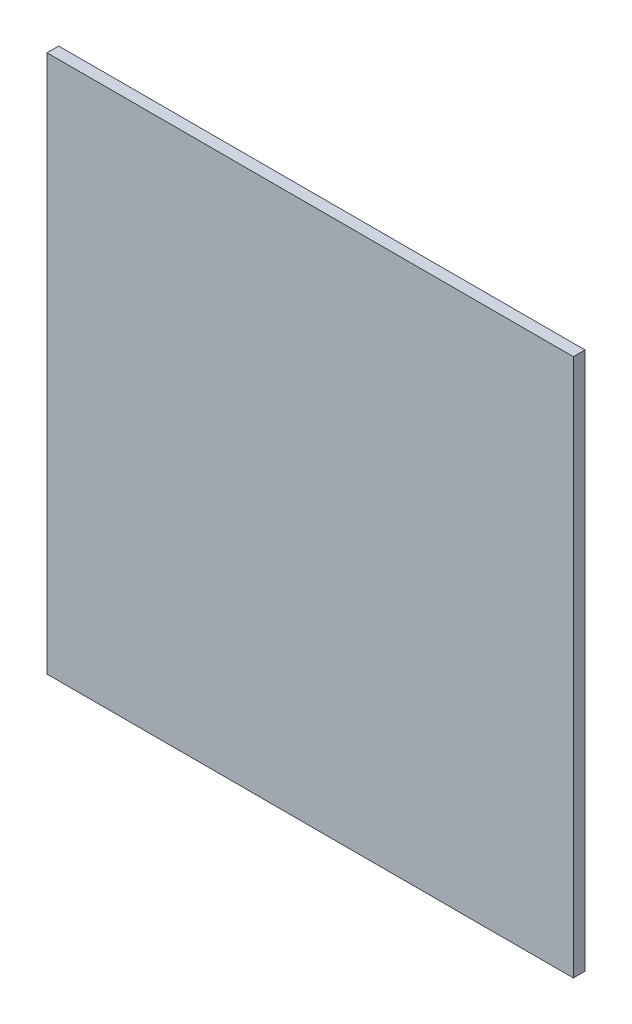
ISO-10303-21;
HEADER;
FILE_DESCRIPTION(('STEP AP214'),'2;1');
FILE_NAME('part.step','',(''),(''),'','','');
FILE_SCHEMA(('AUTOMOTIVE_DESIGN { 1 0 10303 214 1 1 1 1 }'));
ENDSEC;
DATA;
#1=APPLICATION_CONTEXT('core data for automotive mechanical design processes');
#2=APPLICATION_PROTOCOL_DEFINITION('international standard','automotive_design',2000,#1);
#3=PRODUCT_CONTEXT('',#1,'mechanical');
#4=PRODUCT('Part','Part','',(#3));
#5=PRODUCT_RELATED_PRODUCT_CATEGORY('part','',(#4));
#6=PRODUCT_DEFINITION_FORMATION('','',#4);
#7=PRODUCT_DEFINITION_CONTEXT('part definition',#1,'design');
#8=PRODUCT_DEFINITION('design','',#6,#7);
#9=PRODUCT_DEFINITION_SHAPE('','',#8);
#10=(LENGTH_UNIT() NAMED_UNIT(*) SI_UNIT(.MILLI.,.METRE.));
#11=(NAMED_UNIT(*) PLANE_ANGLE_UNIT() SI_UNIT($,.RADIAN.));
#12=(NAMED_UNIT(*) SI_UNIT($,.STERADIAN.) SOLID_ANGLE_UNIT());
#13=UNCERTAINTY_MEASURE_WITH_UNIT(LENGTH_MEASURE(1.E-05),#10,'distance_accuracy_value','');
#14=(GEOMETRIC_REPRESENTATION_CONTEXT(3) GLOBAL_UNCERTAINTY_ASSIGNED_CONTEXT((#13)) GLOBAL_UNIT_ASSIGNED_CONTEXT((#10,
#11,#12)) REPRESENTATION_CONTEXT('',''));
#15=CARTESIAN_POINT('',(0.,0.,0.));
#16=DIRECTION('',(0.,0.,1.));
#17=DIRECTION('',(1.,0.,0.));
#18=AXIS2_PLACEMENT_3D('',#15,#16,#17);
#19=CARTESIAN_POINT('',(-71.4375,-73.025,3.175));
#20=DIRECTION('',(1.,0.,0.));
#21=DIRECTION('',(0.,0.,-1.));
#22=AXIS2_PLACEMENT_3D('',#19,#20,#21);
#23=PLANE('',#22);
#24=DIRECTION('',(0.,-1.,0.));
#25=VECTOR('',#24,1.);
#26=CARTESIAN_POINT('',(-71.4375,-73.025,0.));
#27=LINE('',#26,#25);
#28=CARTESIAN_POINT('',(-71.4375,73.025,0.));
#29=VERTEX_POINT('',#28);
#30=CARTESIAN_POINT('',(-71.4375,-73.025,0.));
#31=VERTEX_POINT('',#30);
#32=EDGE_CURVE('E95',#29,#31,#27,.T.);
#33=ORIENTED_EDGE('',*,*,#32,.T.);
#34=DIRECTION('',(0.,0.,-1.));
#35=VECTOR('',#34,1.);
#36=CARTESIAN_POINT('',(-71.4375,-73.025,3.175));
#37=LINE('',#36,#35);
#38=CARTESIAN_POINT('',(-71.4375,-73.025,3.175));
#39=VERTEX_POINT('',#38);
#40=EDGE_CURVE('E11',#39,#31,#37,.T.);
#41=ORIENTED_EDGE('',*,*,#40,.F.);
#42=DIRECTION('',(0.,-1.,0.));
#43=VECTOR('',#42,1.);
#44=CARTESIAN_POINT('',(-71.4375,-73.025,3.175));
#45=LINE('',#44,#43);
#46=CARTESIAN_POINT('',(-71.4375,73.025,3.175));
#47=VERTEX_POINT('',#46);
#48=EDGE_CURVE('E83',#47,#39,#45,.T.);
#49=ORIENTED_EDGE('',*,*,#48,.F.);
#50=DIRECTION('',(0.,0.,-1.));
#51=VECTOR('',#50,1.);
#52=CARTESIAN_POINT('',(-71.4375,73.025,3.175));
#53=LINE('',#52,#51);
#54=EDGE_CURVE('E91',#47,#29,#53,.T.);
#55=ORIENTED_EDGE('',*,*,#54,.T.);
#56=EDGE_LOOP('',(#33,#41,#49,#55));
#57=FACE_BOUND('',#56,.T.);
#58=ADVANCED_FACE('F32',(#57),#23,.F.);
#59=CARTESIAN_POINT('',(71.4375,-73.0249999999999,3.175));
#60=DIRECTION('',(0.,1.,0.));
#61=DIRECTION('',(-1.,0.,0.));
#62=AXIS2_PLACEMENT_3D('',#59,#60,#61);
#63=PLANE('',#62);
#64=DIRECTION('',(1.,0.,0.));
#65=VECTOR('',#64,1.);
#66=CARTESIAN_POINT('',(71.4375,-73.0249999999999,0.));
#67=LINE('',#66,#65);
#68=CARTESIAN_POINT('',(71.4375,-73.0249999999999,0.));
#69=VERTEX_POINT('',#68);
#70=EDGE_CURVE('E87',#31,#69,#67,.T.);
#71=ORIENTED_EDGE('',*,*,#70,.T.);
#72=DIRECTION('',(0.,0.,-1.));
#73=VECTOR('',#72,1.);
#74=CARTESIAN_POINT('',(71.4375,-73.0249999999999,3.175));
#75=LINE('',#74,#73);
#76=CARTESIAN_POINT('',(71.4375,-73.0249999999999,3.175));
#77=VERTEX_POINT('',#76);
#78=EDGE_CURVE('E40',#77,#69,#75,.T.);
#79=ORIENTED_EDGE('',*,*,#78,.F.);
#80=DIRECTION('',(1.,0.,0.));
#81=VECTOR('',#80,1.);
#82=CARTESIAN_POINT('',(71.4375,-73.0249999999999,3.175));
#83=LINE('',#82,#81);
#84=EDGE_CURVE('E78',#39,#77,#83,.T.);
#85=ORIENTED_EDGE('',*,*,#84,.F.);
#86=ORIENTED_EDGE('',*,*,#40,.T.);
#87=EDGE_LOOP('',(#71,#79,#85,#86));
#88=FACE_BOUND('',#87,.T.);
#89=ADVANCED_FACE('F86',(#88),#63,.F.);
#90=CARTESIAN_POINT('',(71.4375,-73.0249999999999,3.175));
#91=DIRECTION('',(-1.,0.,0.));
#92=DIRECTION('',(0.,0.,1.));
#93=AXIS2_PLACEMENT_3D('',#90,#91,#92);
#94=PLANE('',#93);
#95=DIRECTION('',(0.,1.,0.));
#96=VECTOR('',#95,1.);
#97=CARTESIAN_POINT('',(71.4375,-73.0249999999999,0.));
#98=LINE('',#97,#96);
#99=CARTESIAN_POINT('',(71.4375,73.025,0.));
#100=VERTEX_POINT('',#99);
#101=EDGE_CURVE('E65',#69,#100,#98,.T.);
#102=ORIENTED_EDGE('',*,*,#101,.T.);
#103=DIRECTION('',(0.,0.,-1.));
#104=VECTOR('',#103,1.);
#105=CARTESIAN_POINT('',(71.4375,73.025,3.175));
#106=LINE('',#105,#104);
#107=CARTESIAN_POINT('',(71.4375,73.025,3.175));
#108=VERTEX_POINT('',#107);
#109=EDGE_CURVE('E88',#108,#100,#106,.T.);
#110=ORIENTED_EDGE('',*,*,#109,.F.);
#111=DIRECTION('',(0.,1.,0.));
#112=VECTOR('',#111,1.);
#113=CARTESIAN_POINT('',(71.4375,-73.0249999999999,3.175));
#114=LINE('',#113,#112);
#115=EDGE_CURVE('E81',#77,#108,#114,.T.);
#116=ORIENTED_EDGE('',*,*,#115,.F.);
#117=ORIENTED_EDGE('',*,*,#78,.T.);
#118=EDGE_LOOP('',(#102,#110,#116,#117));
#119=FACE_BOUND('',#118,.T.);
#120=ADVANCED_FACE('F89',(#119),#94,.F.);
#121=CARTESIAN_POINT('',(71.4375,73.025,3.175));
#122=DIRECTION('',(0.,-1.,0.));
#123=DIRECTION('',(1.,0.,0.));
#124=AXIS2_PLACEMENT_3D('',#121,#122,#123);
#125=PLANE('',#124);
#126=DIRECTION('',(-1.,0.,0.));
#127=VECTOR('',#126,1.);
#128=CARTESIAN_POINT('',(71.4375,73.025,0.));
#129=LINE('',#128,#127);
#130=EDGE_CURVE('E71',#100,#29,#129,.T.);
#131=ORIENTED_EDGE('',*,*,#130,.T.);
#132=ORIENTED_EDGE('',*,*,#54,.F.);
#133=DIRECTION('',(-1.,0.,0.));
#134=VECTOR('',#133,1.);
#135=CARTESIAN_POINT('',(71.4375,73.025,3.175));
#136=LINE('',#135,#134);
#137=EDGE_CURVE('E48',#108,#47,#136,.T.);
#138=ORIENTED_EDGE('',*,*,#137,.F.);
#139=ORIENTED_EDGE('',*,*,#109,.T.);
#140=EDGE_LOOP('',(#131,#132,#138,#139));
#141=FACE_BOUND('',#140,.T.);
#142=ADVANCED_FACE('F102',(#141),#125,.F.);
#143=CARTESIAN_POINT('',(0.,0.,3.175));
#144=DIRECTION('',(0.,0.,1.));
#145=DIRECTION('',(1.,0.,0.));
#146=AXIS2_PLACEMENT_3D('',#143,#144,#145);
#147=PLANE('',#146);
#148=ORIENTED_EDGE('',*,*,#48,.T.);
#149=ORIENTED_EDGE('',*,*,#84,.T.);
#150=ORIENTED_EDGE('',*,*,#115,.T.);
#151=ORIENTED_EDGE('',*,*,#137,.T.);
#152=EDGE_LOOP('',(#148,#149,#150,#151));
#153=FACE_BOUND('',#152,.T.);
#154=ADVANCED_FACE('F79',(#153),#147,.T.);
#155=CARTESIAN_POINT('',(0.,0.,0.));
#156=DIRECTION('',(0.,0.,1.));
#157=DIRECTION('',(1.,0.,0.));
#158=AXIS2_PLACEMENT_3D('',#155,#156,#157);
#159=PLANE('',#158);
#160=ORIENTED_EDGE('',*,*,#32,.F.);
#161=ORIENTED_EDGE('',*,*,#130,.F.);
#162=ORIENTED_EDGE('',*,*,#101,.F.);
#163=ORIENTED_EDGE('',*,*,#70,.F.);
#164=EDGE_LOOP('',(#160,#161,#162,#163));
#165=FACE_BOUND('',#164,.T.);
#166=ADVANCED_FACE('F105',(#165),#159,.F.);
#167=CLOSED_SHELL('',(#58,#89,#120,#142,#154,#166));
#168=MANIFOLD_SOLID_BREP('B2',#167);
#169=ADVANCED_BREP_SHAPE_REPRESENTATION('',(#18,#168),#14);
#170=SHAPE_DEFINITION_REPRESENTATION(#9,#169);
ENDSEC;
END-ISO-10303-21;
